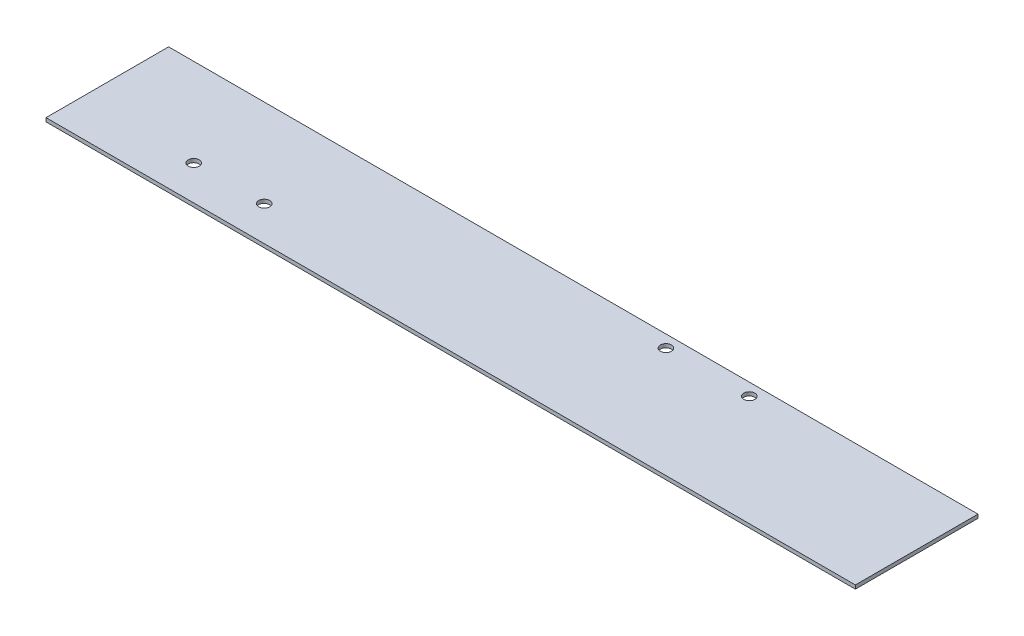
ISO-10303-21;
HEADER;
FILE_DESCRIPTION(('STEP AP214'),'2;1');
FILE_NAME('part.step','',(''),(''),'','','');
FILE_SCHEMA(('AUTOMOTIVE_DESIGN { 1 0 10303 214 1 1 1 1 }'));
ENDSEC;
DATA;
#1=APPLICATION_CONTEXT('core data for automotive mechanical design processes');
#2=APPLICATION_PROTOCOL_DEFINITION('international standard','automotive_design',2000,#1);
#3=PRODUCT_CONTEXT('',#1,'mechanical');
#4=PRODUCT('Part','Part','',(#3));
#5=PRODUCT_RELATED_PRODUCT_CATEGORY('part','',(#4));
#6=PRODUCT_DEFINITION_FORMATION('','',#4);
#7=PRODUCT_DEFINITION_CONTEXT('part definition',#1,'design');
#8=PRODUCT_DEFINITION('design','',#6,#7);
#9=PRODUCT_DEFINITION_SHAPE('','',#8);
#10=(LENGTH_UNIT() NAMED_UNIT(*) SI_UNIT(.MILLI.,.METRE.));
#11=(NAMED_UNIT(*) PLANE_ANGLE_UNIT() SI_UNIT($,.RADIAN.));
#12=(NAMED_UNIT(*) SI_UNIT($,.STERADIAN.) SOLID_ANGLE_UNIT());
#13=UNCERTAINTY_MEASURE_WITH_UNIT(LENGTH_MEASURE(1.E-05),#10,'distance_accuracy_value','');
#14=(GEOMETRIC_REPRESENTATION_CONTEXT(3) GLOBAL_UNCERTAINTY_ASSIGNED_CONTEXT((#13)) GLOBAL_UNIT_ASSIGNED_CONTEXT((#10,
#11,#12)) REPRESENTATION_CONTEXT('',''));
#15=CARTESIAN_POINT('',(0.,0.,0.));
#16=DIRECTION('',(0.,0.,1.));
#17=DIRECTION('',(1.,0.,0.));
#18=AXIS2_PLACEMENT_3D('',#15,#16,#17);
#19=CARTESIAN_POINT('',(-165.,-1.5,25.));
#20=DIRECTION('',(0.,1.,0.));
#21=DIRECTION('',(-1.,0.,0.));
#22=AXIS2_PLACEMENT_3D('',#19,#20,#21);
#23=PLANE('',#22);
#24=CARTESIAN_POINT('',(42.7566628932021,-1.50000000000031,-20.));
#25=DIRECTION('',(0.,1.,0.));
#26=DIRECTION('',(0.,0.,1.));
#27=AXIS2_PLACEMENT_3D('',#24,#25,#26);
#28=CIRCLE('',#27,2.24999999999999);
#29=CARTESIAN_POINT('',(42.7566628932021,-1.50000000000031,-17.75));
#30=VERTEX_POINT('',#29);
#31=EDGE_CURVE('E123',#30,#30,#28,.T.);
#32=ORIENTED_EDGE('',*,*,#31,.T.);
#33=EDGE_LOOP('',(#32));
#34=FACE_BOUND('',#33,.T.);
#35=CARTESIAN_POINT('',(76.7566628932021,-1.5000000000003,-20.));
#36=DIRECTION('',(0.,1.,0.));
#37=DIRECTION('',(0.,0.,1.));
#38=AXIS2_PLACEMENT_3D('',#35,#36,#37);
#39=CIRCLE('',#38,2.24999999999999);
#40=CARTESIAN_POINT('',(76.7566628932021,-1.5000000000003,-17.75));
#41=VERTEX_POINT('',#40);
#42=EDGE_CURVE('E112',#41,#41,#39,.T.);
#43=ORIENTED_EDGE('',*,*,#42,.T.);
#44=EDGE_LOOP('',(#43));
#45=FACE_BOUND('',#44,.T.);
#46=CARTESIAN_POINT('',(-118.87595812484,-1.50000000000028,10.8999999999999));
#47=DIRECTION('',(0.,1.,0.));
#48=DIRECTION('',(0.,0.,1.));
#49=AXIS2_PLACEMENT_3D('',#46,#47,#48);
#50=CIRCLE('',#49,2.24999999999999);
#51=CARTESIAN_POINT('',(-118.87595812484,-1.50000000000028,13.1499999999999));
#52=VERTEX_POINT('',#51);
#53=EDGE_CURVE('E116',#52,#52,#50,.T.);
#54=ORIENTED_EDGE('',*,*,#53,.T.);
#55=EDGE_LOOP('',(#54));
#56=FACE_BOUND('',#55,.T.);
#57=CARTESIAN_POINT('',(-90.1393581248401,-1.50000000000027,10.8999999999999));
#58=DIRECTION('',(0.,1.,0.));
#59=DIRECTION('',(0.,0.,1.));
#60=AXIS2_PLACEMENT_3D('',#57,#58,#59);
#61=CIRCLE('',#60,2.24999999999999);
#62=CARTESIAN_POINT('',(-90.1393581248401,-1.50000000000027,13.1499999999999));
#63=VERTEX_POINT('',#62);
#64=EDGE_CURVE('E101',#63,#63,#61,.T.);
#65=ORIENTED_EDGE('',*,*,#64,.T.);
#66=EDGE_LOOP('',(#65));
#67=FACE_BOUND('',#66,.T.);
#68=DIRECTION('',(1.,0.,0.));
#69=VECTOR('',#68,1.);
#70=CARTESIAN_POINT('',(-165.,-1.5,-25.));
#71=LINE('',#70,#69);
#72=CARTESIAN_POINT('',(-165.,-1.5,-25.));
#73=VERTEX_POINT('',#72);
#74=CARTESIAN_POINT('',(165.,-1.49999999999994,-25.));
#75=VERTEX_POINT('',#74);
#76=EDGE_CURVE('E99',#73,#75,#71,.T.);
#77=ORIENTED_EDGE('',*,*,#76,.T.);
#78=DIRECTION('',(0.,0.,-1.));
#79=VECTOR('',#78,1.);
#80=CARTESIAN_POINT('',(165.,-1.49999999999994,25.));
#81=LINE('',#80,#79);
#82=CARTESIAN_POINT('',(165.,-1.49999999999994,25.));
#83=VERTEX_POINT('',#82);
#84=EDGE_CURVE('E11',#83,#75,#81,.T.);
#85=ORIENTED_EDGE('',*,*,#84,.F.);
#86=DIRECTION('',(1.,0.,0.));
#87=VECTOR('',#86,1.);
#88=CARTESIAN_POINT('',(-165.,-1.5,25.));
#89=LINE('',#88,#87);
#90=CARTESIAN_POINT('',(-165.,-1.5,25.));
#91=VERTEX_POINT('',#90);
#92=EDGE_CURVE('E75',#91,#83,#89,.T.);
#93=ORIENTED_EDGE('',*,*,#92,.F.);
#94=DIRECTION('',(0.,0.,-1.));
#95=VECTOR('',#94,1.);
#96=CARTESIAN_POINT('',(-165.,-1.5,25.));
#97=LINE('',#96,#95);
#98=EDGE_CURVE('E51',#91,#73,#97,.T.);
#99=ORIENTED_EDGE('',*,*,#98,.T.);
#100=EDGE_LOOP('',(#77,#85,#93,#99));
#101=FACE_BOUND('',#100,.T.);
#102=ADVANCED_FACE('F33',(#34,#45,#56,#67,#101),#23,.F.);
#103=CARTESIAN_POINT('',(165.,0.,25.));
#104=DIRECTION('',(1.,0.,0.));
#105=DIRECTION('',(0.,0.,-1.));
#106=AXIS2_PLACEMENT_3D('',#103,#104,#105);
#107=PLANE('',#106);
#108=DIRECTION('',(0.,-1.,0.));
#109=VECTOR('',#108,1.);
#110=CARTESIAN_POINT('',(165.,0.,-25.));
#111=LINE('',#110,#109);
#112=CARTESIAN_POINT('',(165.,0.,-25.));
#113=VERTEX_POINT('',#112);
#114=EDGE_CURVE('E84',#113,#75,#111,.T.);
#115=ORIENTED_EDGE('',*,*,#114,.F.);
#116=DIRECTION('',(0.,0.,-1.));
#117=VECTOR('',#116,1.);
#118=CARTESIAN_POINT('',(165.,0.,25.));
#119=LINE('',#118,#117);
#120=CARTESIAN_POINT('',(165.,0.,25.));
#121=VERTEX_POINT('',#120);
#122=EDGE_CURVE('E42',#121,#113,#119,.T.);
#123=ORIENTED_EDGE('',*,*,#122,.F.);
#124=DIRECTION('',(0.,-1.,0.));
#125=VECTOR('',#124,1.);
#126=CARTESIAN_POINT('',(165.,0.,25.));
#127=LINE('',#126,#125);
#128=EDGE_CURVE('E82',#121,#83,#127,.T.);
#129=ORIENTED_EDGE('',*,*,#128,.T.);
#130=ORIENTED_EDGE('',*,*,#84,.T.);
#131=EDGE_LOOP('',(#115,#123,#129,#130));
#132=FACE_BOUND('',#131,.T.);
#133=ADVANCED_FACE('F81',(#132),#107,.T.);
#134=CARTESIAN_POINT('',(-165.,0.,25.));
#135=DIRECTION('',(0.,1.,0.));
#136=DIRECTION('',(-1.,0.,0.));
#137=AXIS2_PLACEMENT_3D('',#134,#135,#136);
#138=PLANE('',#137);
#139=CARTESIAN_POINT('',(42.7566628932021,0.,-20.));
#140=DIRECTION('',(0.,1.,0.));
#141=DIRECTION('',(-1.,0.,0.));
#142=AXIS2_PLACEMENT_3D('',#139,#140,#141);
#143=CIRCLE('',#142,2.24999999999999);
#144=CARTESIAN_POINT('',(40.5066628932021,0.,-20.));
#145=VERTEX_POINT('',#144);
#146=EDGE_CURVE('E36',#145,#145,#143,.T.);
#147=ORIENTED_EDGE('',*,*,#146,.F.);
#148=EDGE_LOOP('',(#147));
#149=FACE_BOUND('',#148,.T.);
#150=CARTESIAN_POINT('',(76.7566628932021,0.,-20.));
#151=DIRECTION('',(0.,1.,0.));
#152=DIRECTION('',(-1.,0.,0.));
#153=AXIS2_PLACEMENT_3D('',#150,#151,#152);
#154=CIRCLE('',#153,2.24999999999999);
#155=CARTESIAN_POINT('',(74.5066628932021,0.,-20.));
#156=VERTEX_POINT('',#155);
#157=EDGE_CURVE('E109',#156,#156,#154,.T.);
#158=ORIENTED_EDGE('',*,*,#157,.F.);
#159=EDGE_LOOP('',(#158));
#160=FACE_BOUND('',#159,.T.);
#161=CARTESIAN_POINT('',(-118.87595812484,0.,10.8999999999999));
#162=DIRECTION('',(0.,1.,0.));
#163=DIRECTION('',(0.,0.,1.));
#164=AXIS2_PLACEMENT_3D('',#161,#162,#163);
#165=CIRCLE('',#164,2.24999999999999);
#166=CARTESIAN_POINT('',(-118.87595812484,0.,13.1499999999999));
#167=VERTEX_POINT('',#166);
#168=EDGE_CURVE('E111',#167,#167,#165,.T.);
#169=ORIENTED_EDGE('',*,*,#168,.F.);
#170=EDGE_LOOP('',(#169));
#171=FACE_BOUND('',#170,.T.);
#172=CARTESIAN_POINT('',(-90.1393581248401,0.,10.8999999999999));
#173=DIRECTION('',(0.,1.,0.));
#174=DIRECTION('',(0.,0.,1.));
#175=AXIS2_PLACEMENT_3D('',#172,#173,#174);
#176=CIRCLE('',#175,2.24999999999999);
#177=CARTESIAN_POINT('',(-90.1393581248401,0.,13.1499999999999));
#178=VERTEX_POINT('',#177);
#179=EDGE_CURVE('E128',#178,#178,#176,.T.);
#180=ORIENTED_EDGE('',*,*,#179,.F.);
#181=EDGE_LOOP('',(#180));
#182=FACE_BOUND('',#181,.T.);
#183=DIRECTION('',(1.,0.,0.));
#184=VECTOR('',#183,1.);
#185=CARTESIAN_POINT('',(-165.,0.,-25.));
#186=LINE('',#185,#184);
#187=CARTESIAN_POINT('',(-165.,0.,-25.));
#188=VERTEX_POINT('',#187);
#189=EDGE_CURVE('E103',#188,#113,#186,.T.);
#190=ORIENTED_EDGE('',*,*,#189,.F.);
#191=DIRECTION('',(0.,0.,-1.));
#192=VECTOR('',#191,1.);
#193=CARTESIAN_POINT('',(-165.,0.,25.));
#194=LINE('',#193,#192);
#195=CARTESIAN_POINT('',(-165.,0.,25.));
#196=VERTEX_POINT('',#195);
#197=EDGE_CURVE('E64',#196,#188,#194,.T.);
#198=ORIENTED_EDGE('',*,*,#197,.F.);
#199=DIRECTION('',(1.,0.,0.));
#200=VECTOR('',#199,1.);
#201=CARTESIAN_POINT('',(-165.,0.,25.));
#202=LINE('',#201,#200);
#203=EDGE_CURVE('E91',#196,#121,#202,.T.);
#204=ORIENTED_EDGE('',*,*,#203,.T.);
#205=ORIENTED_EDGE('',*,*,#122,.T.);
#206=EDGE_LOOP('',(#190,#198,#204,#205));
#207=FACE_BOUND('',#206,.T.);
#208=ADVANCED_FACE('F93',(#149,#160,#171,#182,#207),#138,.T.);
#209=CARTESIAN_POINT('',(-165.,-1.5,25.));
#210=DIRECTION('',(-1.,0.,0.));
#211=DIRECTION('',(0.,0.,1.));
#212=AXIS2_PLACEMENT_3D('',#209,#210,#211);
#213=PLANE('',#212);
#214=DIRECTION('',(0.,1.,0.));
#215=VECTOR('',#214,1.);
#216=CARTESIAN_POINT('',(-165.,-1.5,-25.));
#217=LINE('',#216,#215);
#218=EDGE_CURVE('E105',#73,#188,#217,.T.);
#219=ORIENTED_EDGE('',*,*,#218,.F.);
#220=ORIENTED_EDGE('',*,*,#98,.F.);
#221=DIRECTION('',(0.,1.,0.));
#222=VECTOR('',#221,1.);
#223=CARTESIAN_POINT('',(-165.,-1.5,25.));
#224=LINE('',#223,#222);
#225=EDGE_CURVE('E94',#91,#196,#224,.T.);
#226=ORIENTED_EDGE('',*,*,#225,.T.);
#227=ORIENTED_EDGE('',*,*,#197,.T.);
#228=EDGE_LOOP('',(#219,#220,#226,#227));
#229=FACE_BOUND('',#228,.T.);
#230=ADVANCED_FACE('F144',(#229),#213,.T.);
#231=CARTESIAN_POINT('',(165.,-1.49999999999994,25.));
#232=DIRECTION('',(0.,0.,-1.));
#233=DIRECTION('',(-1.,0.,0.));
#234=AXIS2_PLACEMENT_3D('',#231,#232,#233);
#235=PLANE('',#234);
#236=ORIENTED_EDGE('',*,*,#92,.T.);
#237=ORIENTED_EDGE('',*,*,#128,.F.);
#238=ORIENTED_EDGE('',*,*,#203,.F.);
#239=ORIENTED_EDGE('',*,*,#225,.F.);
#240=EDGE_LOOP('',(#236,#237,#238,#239));
#241=FACE_BOUND('',#240,.T.);
#242=ADVANCED_FACE('F90',(#241),#235,.F.);
#243=CARTESIAN_POINT('',(165.,-1.49999999999994,-25.));
#244=DIRECTION('',(0.,0.,-1.));
#245=DIRECTION('',(-1.,0.,0.));
#246=AXIS2_PLACEMENT_3D('',#243,#244,#245);
#247=PLANE('',#246);
#248=ORIENTED_EDGE('',*,*,#76,.F.);
#249=ORIENTED_EDGE('',*,*,#218,.T.);
#250=ORIENTED_EDGE('',*,*,#189,.T.);
#251=ORIENTED_EDGE('',*,*,#114,.T.);
#252=EDGE_LOOP('',(#248,#249,#250,#251));
#253=FACE_BOUND('',#252,.T.);
#254=ADVANCED_FACE('F139',(#253),#247,.T.);
#255=CARTESIAN_POINT('',(-90.1393581248401,0.,10.8999999999999));
#256=DIRECTION('',(0.,1.,0.));
#257=DIRECTION('',(0.,0.,1.));
#258=AXIS2_PLACEMENT_3D('',#255,#256,#257);
#259=CYLINDRICAL_SURFACE('',#258,2.24999999999999);
#260=ORIENTED_EDGE('',*,*,#64,.F.);
#261=EDGE_LOOP('',(#260));
#262=FACE_BOUND('',#261,.T.);
#263=ORIENTED_EDGE('',*,*,#179,.T.);
#264=EDGE_LOOP('',(#263));
#265=FACE_BOUND('',#264,.T.);
#266=ADVANCED_FACE('F135',(#262,#265),#259,.F.);
#267=CARTESIAN_POINT('',(-118.87595812484,0.,10.8999999999999));
#268=DIRECTION('',(0.,1.,0.));
#269=DIRECTION('',(0.,0.,1.));
#270=AXIS2_PLACEMENT_3D('',#267,#268,#269);
#271=CYLINDRICAL_SURFACE('',#270,2.24999999999999);
#272=ORIENTED_EDGE('',*,*,#53,.F.);
#273=EDGE_LOOP('',(#272));
#274=FACE_BOUND('',#273,.T.);
#275=ORIENTED_EDGE('',*,*,#168,.T.);
#276=EDGE_LOOP('',(#275));
#277=FACE_BOUND('',#276,.T.);
#278=ADVANCED_FACE('F138',(#274,#277),#271,.F.);
#279=CARTESIAN_POINT('',(76.7566628932021,1.60000000000004,-20.));
#280=DIRECTION('',(0.,1.,0.));
#281=DIRECTION('',(0.,0.,1.));
#282=AXIS2_PLACEMENT_3D('',#279,#280,#281);
#283=CYLINDRICAL_SURFACE('',#282,2.24999999999999);
#284=ORIENTED_EDGE('',*,*,#157,.T.);
#285=EDGE_LOOP('',(#284));
#286=FACE_BOUND('',#285,.T.);
#287=ORIENTED_EDGE('',*,*,#42,.F.);
#288=EDGE_LOOP('',(#287));
#289=FACE_BOUND('',#288,.T.);
#290=ADVANCED_FACE('F165',(#286,#289),#283,.F.);
#291=CARTESIAN_POINT('',(42.7566628932021,1.60000000000003,-20.));
#292=DIRECTION('',(0.,1.,0.));
#293=DIRECTION('',(0.,0.,1.));
#294=AXIS2_PLACEMENT_3D('',#291,#292,#293);
#295=CYLINDRICAL_SURFACE('',#294,2.24999999999999);
#296=ORIENTED_EDGE('',*,*,#146,.T.);
#297=EDGE_LOOP('',(#296));
#298=FACE_BOUND('',#297,.T.);
#299=ORIENTED_EDGE('',*,*,#31,.F.);
#300=EDGE_LOOP('',(#299));
#301=FACE_BOUND('',#300,.T.);
#302=ADVANCED_FACE('F172',(#298,#301),#295,.F.);
#303=CLOSED_SHELL('',(#102,#133,#208,#230,#242,#254,#266,#278,#290,#302));
#304=MANIFOLD_SOLID_BREP('B2',#303);
#305=ADVANCED_BREP_SHAPE_REPRESENTATION('',(#18,#304),#14);
#306=SHAPE_DEFINITION_REPRESENTATION(#9,#305);
ENDSEC;
END-ISO-10303-21;
